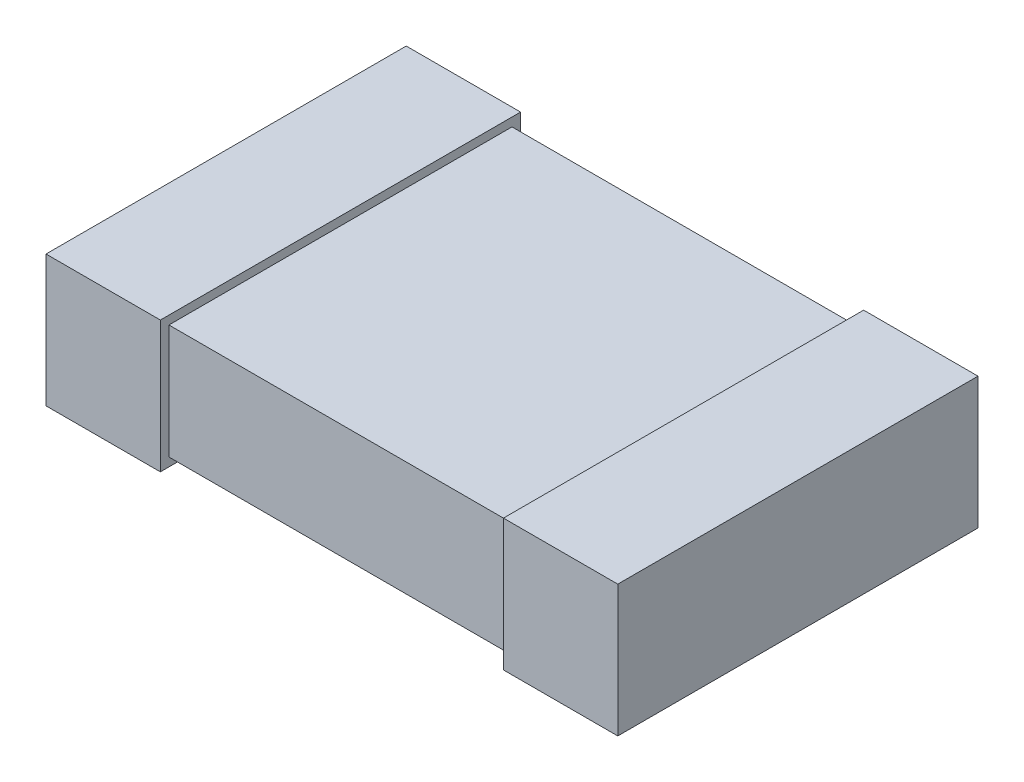
ISO-10303-21;
HEADER;
FILE_DESCRIPTION(('STEP AP214'),'2;1');
FILE_NAME('part.step','',(''),(''),'','','');
FILE_SCHEMA(('AUTOMOTIVE_DESIGN { 1 0 10303 214 1 1 1 1 }'));
ENDSEC;
DATA;
#1=APPLICATION_CONTEXT('core data for automotive mechanical design processes');
#2=APPLICATION_PROTOCOL_DEFINITION('international standard','automotive_design',2000,#1);
#3=PRODUCT_CONTEXT('',#1,'mechanical');
#4=PRODUCT('Part','Part','',(#3));
#5=PRODUCT_RELATED_PRODUCT_CATEGORY('part','',(#4));
#6=PRODUCT_DEFINITION_FORMATION('','',#4);
#7=PRODUCT_DEFINITION_CONTEXT('part definition',#1,'design');
#8=PRODUCT_DEFINITION('design','',#6,#7);
#9=PRODUCT_DEFINITION_SHAPE('','',#8);
#10=(LENGTH_UNIT() NAMED_UNIT(*) SI_UNIT(.MILLI.,.METRE.));
#11=(NAMED_UNIT(*) PLANE_ANGLE_UNIT() SI_UNIT($,.RADIAN.));
#12=(NAMED_UNIT(*) SI_UNIT($,.STERADIAN.) SOLID_ANGLE_UNIT());
#13=UNCERTAINTY_MEASURE_WITH_UNIT(LENGTH_MEASURE(1.E-05),#10,'distance_accuracy_value','');
#14=(GEOMETRIC_REPRESENTATION_CONTEXT(3) GLOBAL_UNCERTAINTY_ASSIGNED_CONTEXT((#13)) GLOBAL_UNIT_ASSIGNED_CONTEXT((#10,
#11,#12)) REPRESENTATION_CONTEXT('',''));
#15=CARTESIAN_POINT('',(0.,0.,0.));
#16=DIRECTION('',(0.,0.,1.));
#17=DIRECTION('',(1.,0.,0.));
#18=AXIS2_PLACEMENT_3D('',#15,#16,#17);
#19=CARTESIAN_POINT('',(-1.,0.4,0.6));
#20=DIRECTION('',(0.,0.,-1.));
#21=DIRECTION('',(-1.,0.,0.));
#22=AXIS2_PLACEMENT_3D('',#19,#20,#21);
#23=PLANE('',#22);
#24=DIRECTION('',(0.,-1.,0.));
#25=VECTOR('',#24,1.);
#26=CARTESIAN_POINT('',(0.6,0.4,0.6));
#27=LINE('',#26,#25);
#28=CARTESIAN_POINT('',(0.6,0.4,0.6));
#29=VERTEX_POINT('',#28);
#30=CARTESIAN_POINT('',(0.6,0.,0.6));
#31=VERTEX_POINT('',#30);
#32=EDGE_CURVE('E50',#29,#31,#27,.T.);
#33=ORIENTED_EDGE('',*,*,#32,.F.);
#34=DIRECTION('',(1.,0.,0.));
#35=VECTOR('',#34,1.);
#36=CARTESIAN_POINT('',(-1.,0.4,0.6));
#37=LINE('',#36,#35);
#38=CARTESIAN_POINT('',(-0.6,0.4,0.6));
#39=VERTEX_POINT('',#38);
#40=EDGE_CURVE('E215',#39,#29,#37,.T.);
#41=ORIENTED_EDGE('',*,*,#40,.F.);
#42=DIRECTION('',(0.,1.,0.));
#43=VECTOR('',#42,1.);
#44=CARTESIAN_POINT('',(-0.6,0.4,0.6));
#45=LINE('',#44,#43);
#46=CARTESIAN_POINT('',(-0.6,0.,0.6));
#47=VERTEX_POINT('',#46);
#48=EDGE_CURVE('E209',#47,#39,#45,.T.);
#49=ORIENTED_EDGE('',*,*,#48,.F.);
#50=DIRECTION('',(1.,0.,0.));
#51=VECTOR('',#50,1.);
#52=CARTESIAN_POINT('',(-1.,0.,0.6));
#53=LINE('',#52,#51);
#54=EDGE_CURVE('E214',#47,#31,#53,.T.);
#55=ORIENTED_EDGE('',*,*,#54,.T.);
#56=EDGE_LOOP('',(#33,#41,#49,#55));
#57=FACE_BOUND('',#56,.T.);
#58=ADVANCED_FACE('F35',(#57),#23,.F.);
#59=CARTESIAN_POINT('',(-1.,0.4,-0.6));
#60=DIRECTION('',(0.,0.,1.));
#61=DIRECTION('',(1.,0.,0.));
#62=AXIS2_PLACEMENT_3D('',#59,#60,#61);
#63=PLANE('',#62);
#64=DIRECTION('',(0.,1.,0.));
#65=VECTOR('',#64,1.);
#66=CARTESIAN_POINT('',(0.6,0.4,-0.6));
#67=LINE('',#66,#65);
#68=CARTESIAN_POINT('',(0.6,0.,-0.6));
#69=VERTEX_POINT('',#68);
#70=CARTESIAN_POINT('',(0.6,0.4,-0.6));
#71=VERTEX_POINT('',#70);
#72=EDGE_CURVE('E164',#69,#71,#67,.T.);
#73=ORIENTED_EDGE('',*,*,#72,.F.);
#74=DIRECTION('',(-1.,0.,0.));
#75=VECTOR('',#74,1.);
#76=CARTESIAN_POINT('',(-1.,0.,-0.6));
#77=LINE('',#76,#75);
#78=CARTESIAN_POINT('',(-0.6,0.,-0.6));
#79=VERTEX_POINT('',#78);
#80=EDGE_CURVE('E218',#69,#79,#77,.T.);
#81=ORIENTED_EDGE('',*,*,#80,.T.);
#82=DIRECTION('',(0.,-1.,0.));
#83=VECTOR('',#82,1.);
#84=CARTESIAN_POINT('',(-0.6,0.4,-0.6));
#85=LINE('',#84,#83);
#86=CARTESIAN_POINT('',(-0.6,0.4,-0.6));
#87=VERTEX_POINT('',#86);
#88=EDGE_CURVE('E197',#87,#79,#85,.T.);
#89=ORIENTED_EDGE('',*,*,#88,.F.);
#90=DIRECTION('',(-1.,0.,0.));
#91=VECTOR('',#90,1.);
#92=CARTESIAN_POINT('',(-1.,0.4,-0.6));
#93=LINE('',#92,#91);
#94=EDGE_CURVE('E217',#71,#87,#93,.T.);
#95=ORIENTED_EDGE('',*,*,#94,.F.);
#96=EDGE_LOOP('',(#73,#81,#89,#95));
#97=FACE_BOUND('',#96,.T.);
#98=ADVANCED_FACE('F235',(#97),#63,.F.);
#99=CARTESIAN_POINT('',(-1.,0.4,0.6));
#100=DIRECTION('',(0.,1.,0.));
#101=DIRECTION('',(0.,0.,1.));
#102=AXIS2_PLACEMENT_3D('',#99,#100,#101);
#103=PLANE('',#102);
#104=ORIENTED_EDGE('',*,*,#40,.T.);
#105=DIRECTION('',(0.,0.,-1.));
#106=VECTOR('',#105,1.);
#107=CARTESIAN_POINT('',(0.6,0.4,0.6));
#108=LINE('',#107,#106);
#109=EDGE_CURVE('E57',#29,#71,#108,.T.);
#110=ORIENTED_EDGE('',*,*,#109,.T.);
#111=ORIENTED_EDGE('',*,*,#94,.T.);
#112=DIRECTION('',(0.,0.,1.));
#113=VECTOR('',#112,1.);
#114=CARTESIAN_POINT('',(-0.6,0.4,0.6));
#115=LINE('',#114,#113);
#116=EDGE_CURVE('E212',#87,#39,#115,.T.);
#117=ORIENTED_EDGE('',*,*,#116,.T.);
#118=EDGE_LOOP('',(#104,#110,#111,#117));
#119=FACE_BOUND('',#118,.T.);
#120=ADVANCED_FACE('F232',(#119),#103,.T.);
#121=CARTESIAN_POINT('',(-1.,0.,0.6));
#122=DIRECTION('',(0.,1.,0.));
#123=DIRECTION('',(0.,0.,1.));
#124=AXIS2_PLACEMENT_3D('',#121,#122,#123);
#125=PLANE('',#124);
#126=DIRECTION('',(0.,0.,-1.));
#127=VECTOR('',#126,1.);
#128=CARTESIAN_POINT('',(0.6,0.,0.6));
#129=LINE('',#128,#127);
#130=EDGE_CURVE('E12',#31,#69,#129,.T.);
#131=ORIENTED_EDGE('',*,*,#130,.F.);
#132=ORIENTED_EDGE('',*,*,#54,.F.);
#133=DIRECTION('',(0.,0.,1.));
#134=VECTOR('',#133,1.);
#135=CARTESIAN_POINT('',(-0.6,0.,0.6));
#136=LINE('',#135,#134);
#137=EDGE_CURVE('E43',#79,#47,#136,.T.);
#138=ORIENTED_EDGE('',*,*,#137,.F.);
#139=ORIENTED_EDGE('',*,*,#80,.F.);
#140=EDGE_LOOP('',(#131,#132,#138,#139));
#141=FACE_BOUND('',#140,.T.);
#142=ADVANCED_FACE('F230',(#141),#125,.F.);
#143=CARTESIAN_POINT('',(-0.6,-0.0299999999999999,1.26959002616513));
#144=DIRECTION('',(0.,1.,0.));
#145=DIRECTION('',(-1.,0.,0.));
#146=AXIS2_PLACEMENT_3D('',#143,#144,#145);
#147=PLANE('',#146);
#148=DIRECTION('',(0.,0.,-1.));
#149=VECTOR('',#148,1.);
#150=CARTESIAN_POINT('',(-0.6,-0.0299999999999999,1.26959002616513));
#151=LINE('',#150,#149);
#152=CARTESIAN_POINT('',(-0.6,-0.0299999999999999,0.63));
#153=VERTEX_POINT('',#152);
#154=CARTESIAN_POINT('',(-0.6,-0.0299999999999999,-0.63));
#155=VERTEX_POINT('',#154);
#156=EDGE_CURVE('E186',#153,#155,#151,.T.);
#157=ORIENTED_EDGE('',*,*,#156,.F.);
#158=DIRECTION('',(-1.,0.,0.));
#159=VECTOR('',#158,1.);
#160=CARTESIAN_POINT('',(-0.6,-0.0299999999999999,0.63));
#161=LINE('',#160,#159);
#162=CARTESIAN_POINT('',(-1.,-0.03,0.63));
#163=VERTEX_POINT('',#162);
#164=EDGE_CURVE('E191',#153,#163,#161,.T.);
#165=ORIENTED_EDGE('',*,*,#164,.T.);
#166=DIRECTION('',(0.,0.,-1.));
#167=VECTOR('',#166,1.);
#168=CARTESIAN_POINT('',(-1.,-0.03,1.26959002616513));
#169=LINE('',#168,#167);
#170=CARTESIAN_POINT('',(-1.,-0.03,-0.63));
#171=VERTEX_POINT('',#170);
#172=EDGE_CURVE('E199',#163,#171,#169,.T.);
#173=ORIENTED_EDGE('',*,*,#172,.T.);
#174=DIRECTION('',(-1.,0.,0.));
#175=VECTOR('',#174,1.);
#176=CARTESIAN_POINT('',(-0.6,-0.0299999999999999,-0.63));
#177=LINE('',#176,#175);
#178=EDGE_CURVE('E177',#155,#171,#177,.T.);
#179=ORIENTED_EDGE('',*,*,#178,.F.);
#180=EDGE_LOOP('',(#157,#165,#173,#179));
#181=FACE_BOUND('',#180,.T.);
#182=ADVANCED_FACE('F276',(#181),#147,.F.);
#183=CARTESIAN_POINT('',(-0.6,0.43,1.26959002616513));
#184=DIRECTION('',(0.,-1.,0.));
#185=DIRECTION('',(1.,0.,0.));
#186=AXIS2_PLACEMENT_3D('',#183,#184,#185);
#187=PLANE('',#186);
#188=DIRECTION('',(0.,0.,-1.));
#189=VECTOR('',#188,1.);
#190=CARTESIAN_POINT('',(-1.,0.43,1.26959002616513));
#191=LINE('',#190,#189);
#192=CARTESIAN_POINT('',(-1.,0.43,0.63));
#193=VERTEX_POINT('',#192);
#194=CARTESIAN_POINT('',(-1.,0.43,-0.63));
#195=VERTEX_POINT('',#194);
#196=EDGE_CURVE('E201',#193,#195,#191,.T.);
#197=ORIENTED_EDGE('',*,*,#196,.F.);
#198=DIRECTION('',(1.,0.,0.));
#199=VECTOR('',#198,1.);
#200=CARTESIAN_POINT('',(-0.6,0.43,0.63));
#201=LINE('',#200,#199);
#202=CARTESIAN_POINT('',(-0.6,0.43,0.63));
#203=VERTEX_POINT('',#202);
#204=EDGE_CURVE('E190',#193,#203,#201,.T.);
#205=ORIENTED_EDGE('',*,*,#204,.T.);
#206=DIRECTION('',(0.,0.,-1.));
#207=VECTOR('',#206,1.);
#208=CARTESIAN_POINT('',(-0.6,0.43,1.26959002616513));
#209=LINE('',#208,#207);
#210=CARTESIAN_POINT('',(-0.6,0.43,-0.63));
#211=VERTEX_POINT('',#210);
#212=EDGE_CURVE('E203',#203,#211,#209,.T.);
#213=ORIENTED_EDGE('',*,*,#212,.T.);
#214=DIRECTION('',(1.,0.,0.));
#215=VECTOR('',#214,1.);
#216=CARTESIAN_POINT('',(-0.6,0.43,-0.63));
#217=LINE('',#216,#215);
#218=EDGE_CURVE('E183',#195,#211,#217,.T.);
#219=ORIENTED_EDGE('',*,*,#218,.F.);
#220=EDGE_LOOP('',(#197,#205,#213,#219));
#221=FACE_BOUND('',#220,.T.);
#222=ADVANCED_FACE('F279',(#221),#187,.F.);
#223=CARTESIAN_POINT('',(-0.6,0.43,1.26959002616513));
#224=DIRECTION('',(-1.,0.,0.));
#225=DIRECTION('',(0.,-1.,0.));
#226=AXIS2_PLACEMENT_3D('',#223,#224,#225);
#227=PLANE('',#226);
#228=ORIENTED_EDGE('',*,*,#116,.F.);
#229=ORIENTED_EDGE('',*,*,#88,.T.);
#230=ORIENTED_EDGE('',*,*,#137,.T.);
#231=ORIENTED_EDGE('',*,*,#48,.T.);
#232=EDGE_LOOP('',(#228,#229,#230,#231));
#233=FACE_BOUND('',#232,.T.);
#234=ORIENTED_EDGE('',*,*,#212,.F.);
#235=DIRECTION('',(0.,-1.,0.));
#236=VECTOR('',#235,1.);
#237=CARTESIAN_POINT('',(-0.6,0.43,0.63));
#238=LINE('',#237,#236);
#239=EDGE_CURVE('E194',#203,#153,#238,.T.);
#240=ORIENTED_EDGE('',*,*,#239,.T.);
#241=ORIENTED_EDGE('',*,*,#156,.T.);
#242=DIRECTION('',(0.,-1.,0.));
#243=VECTOR('',#242,1.);
#244=CARTESIAN_POINT('',(-0.6,0.43,-0.63));
#245=LINE('',#244,#243);
#246=EDGE_CURVE('E180',#211,#155,#245,.T.);
#247=ORIENTED_EDGE('',*,*,#246,.F.);
#248=EDGE_LOOP('',(#234,#240,#241,#247));
#249=FACE_BOUND('',#248,.T.);
#250=ADVANCED_FACE('F225',(#233,#249),#227,.F.);
#251=CARTESIAN_POINT('',(-1.,0.4,0.63));
#252=DIRECTION('',(0.,0.,-1.));
#253=DIRECTION('',(-1.,0.,0.));
#254=AXIS2_PLACEMENT_3D('',#251,#252,#253);
#255=PLANE('',#254);
#256=ORIENTED_EDGE('',*,*,#204,.F.);
#257=DIRECTION('',(0.,1.,0.));
#258=VECTOR('',#257,1.);
#259=CARTESIAN_POINT('',(-1.,0.43,0.63));
#260=LINE('',#259,#258);
#261=EDGE_CURVE('E187',#163,#193,#260,.T.);
#262=ORIENTED_EDGE('',*,*,#261,.F.);
#263=ORIENTED_EDGE('',*,*,#164,.F.);
#264=ORIENTED_EDGE('',*,*,#239,.F.);
#265=EDGE_LOOP('',(#256,#262,#263,#264));
#266=FACE_BOUND('',#265,.T.);
#267=ADVANCED_FACE('F271',(#266),#255,.F.);
#268=CARTESIAN_POINT('',(-1.,0.4,-0.63));
#269=DIRECTION('',(0.,0.,1.));
#270=DIRECTION('',(1.,0.,0.));
#271=AXIS2_PLACEMENT_3D('',#268,#269,#270);
#272=PLANE('',#271);
#273=ORIENTED_EDGE('',*,*,#246,.T.);
#274=ORIENTED_EDGE('',*,*,#178,.T.);
#275=DIRECTION('',(0.,1.,0.));
#276=VECTOR('',#275,1.);
#277=CARTESIAN_POINT('',(-1.,0.43,-0.63));
#278=LINE('',#277,#276);
#279=EDGE_CURVE('E174',#171,#195,#278,.T.);
#280=ORIENTED_EDGE('',*,*,#279,.T.);
#281=ORIENTED_EDGE('',*,*,#218,.T.);
#282=EDGE_LOOP('',(#273,#274,#280,#281));
#283=FACE_BOUND('',#282,.T.);
#284=ADVANCED_FACE('F268',(#283),#272,.F.);
#285=CARTESIAN_POINT('',(-1.,0.4,-0.6));
#286=DIRECTION('',(1.,0.,0.));
#287=DIRECTION('',(0.,0.,-1.));
#288=AXIS2_PLACEMENT_3D('',#285,#286,#287);
#289=PLANE('',#288);
#290=ORIENTED_EDGE('',*,*,#172,.F.);
#291=ORIENTED_EDGE('',*,*,#261,.T.);
#292=ORIENTED_EDGE('',*,*,#196,.T.);
#293=ORIENTED_EDGE('',*,*,#279,.F.);
#294=EDGE_LOOP('',(#290,#291,#292,#293));
#295=FACE_BOUND('',#294,.T.);
#296=ADVANCED_FACE('F37',(#295),#289,.F.);
#297=CARTESIAN_POINT('',(0.6,-0.0299999999999998,1.26959002616513));
#298=DIRECTION('',(0.,1.,0.));
#299=DIRECTION('',(-1.,0.,0.));
#300=AXIS2_PLACEMENT_3D('',#297,#298,#299);
#301=PLANE('',#300);
#302=DIRECTION('',(0.,0.,-1.));
#303=VECTOR('',#302,1.);
#304=CARTESIAN_POINT('',(1.,-0.0299999999999997,1.26959002616513));
#305=LINE('',#304,#303);
#306=CARTESIAN_POINT('',(1.,-0.0299999999999997,0.63));
#307=VERTEX_POINT('',#306);
#308=CARTESIAN_POINT('',(1.,-0.0299999999999997,-0.63));
#309=VERTEX_POINT('',#308);
#310=EDGE_CURVE('E137',#307,#309,#305,.T.);
#311=ORIENTED_EDGE('',*,*,#310,.F.);
#312=DIRECTION('',(-1.,0.,0.));
#313=VECTOR('',#312,1.);
#314=CARTESIAN_POINT('',(0.6,-0.0299999999999998,0.63));
#315=LINE('',#314,#313);
#316=CARTESIAN_POINT('',(0.6,-0.0299999999999998,0.63));
#317=VERTEX_POINT('',#316);
#318=EDGE_CURVE('E132',#307,#317,#315,.T.);
#319=ORIENTED_EDGE('',*,*,#318,.T.);
#320=DIRECTION('',(0.,0.,-1.));
#321=VECTOR('',#320,1.);
#322=CARTESIAN_POINT('',(0.6,-0.0299999999999998,1.26959002616513));
#323=LINE('',#322,#321);
#324=CARTESIAN_POINT('',(0.6,-0.0299999999999998,-0.63));
#325=VERTEX_POINT('',#324);
#326=EDGE_CURVE('E127',#317,#325,#323,.T.);
#327=ORIENTED_EDGE('',*,*,#326,.T.);
#328=DIRECTION('',(-1.,0.,0.));
#329=VECTOR('',#328,1.);
#330=CARTESIAN_POINT('',(0.6,-0.0299999999999998,-0.63));
#331=LINE('',#330,#329);
#332=EDGE_CURVE('E131',#309,#325,#331,.T.);
#333=ORIENTED_EDGE('',*,*,#332,.F.);
#334=EDGE_LOOP('',(#311,#319,#327,#333));
#335=FACE_BOUND('',#334,.T.);
#336=ADVANCED_FACE('F130',(#335),#301,.F.);
#337=CARTESIAN_POINT('',(0.6,0.43,1.26959002616513));
#338=DIRECTION('',(1.,0.,0.));
#339=DIRECTION('',(0.,1.,0.));
#340=AXIS2_PLACEMENT_3D('',#337,#338,#339);
#341=PLANE('',#340);
#342=ORIENTED_EDGE('',*,*,#109,.F.);
#343=ORIENTED_EDGE('',*,*,#32,.T.);
#344=ORIENTED_EDGE('',*,*,#130,.T.);
#345=ORIENTED_EDGE('',*,*,#72,.T.);
#346=EDGE_LOOP('',(#342,#343,#344,#345));
#347=FACE_BOUND('',#346,.T.);
#348=ORIENTED_EDGE('',*,*,#326,.F.);
#349=DIRECTION('',(0.,1.,0.));
#350=VECTOR('',#349,1.);
#351=CARTESIAN_POINT('',(0.6,0.43,0.63));
#352=LINE('',#351,#350);
#353=CARTESIAN_POINT('',(0.6,0.43,0.63));
#354=VERTEX_POINT('',#353);
#355=EDGE_CURVE('E159',#317,#354,#352,.T.);
#356=ORIENTED_EDGE('',*,*,#355,.T.);
#357=DIRECTION('',(0.,0.,-1.));
#358=VECTOR('',#357,1.);
#359=CARTESIAN_POINT('',(0.6,0.43,1.26959002616513));
#360=LINE('',#359,#358);
#361=CARTESIAN_POINT('',(0.6,0.43,-0.63));
#362=VERTEX_POINT('',#361);
#363=EDGE_CURVE('E136',#354,#362,#360,.T.);
#364=ORIENTED_EDGE('',*,*,#363,.T.);
#365=DIRECTION('',(0.,1.,0.));
#366=VECTOR('',#365,1.);
#367=CARTESIAN_POINT('',(0.6,0.43,-0.63));
#368=LINE('',#367,#366);
#369=EDGE_CURVE('E144',#325,#362,#368,.T.);
#370=ORIENTED_EDGE('',*,*,#369,.F.);
#371=EDGE_LOOP('',(#348,#356,#364,#370));
#372=FACE_BOUND('',#371,.T.);
#373=ADVANCED_FACE('F149',(#347,#372),#341,.F.);
#374=CARTESIAN_POINT('',(0.6,0.43,1.26959002616513));
#375=DIRECTION('',(0.,-1.,0.));
#376=DIRECTION('',(1.,0.,0.));
#377=AXIS2_PLACEMENT_3D('',#374,#375,#376);
#378=PLANE('',#377);
#379=ORIENTED_EDGE('',*,*,#363,.F.);
#380=DIRECTION('',(1.,0.,0.));
#381=VECTOR('',#380,1.);
#382=CARTESIAN_POINT('',(0.6,0.43,0.63));
#383=LINE('',#382,#381);
#384=CARTESIAN_POINT('',(1.,0.43,0.63));
#385=VERTEX_POINT('',#384);
#386=EDGE_CURVE('E162',#354,#385,#383,.T.);
#387=ORIENTED_EDGE('',*,*,#386,.T.);
#388=DIRECTION('',(0.,0.,-1.));
#389=VECTOR('',#388,1.);
#390=CARTESIAN_POINT('',(1.,0.43,1.26959002616513));
#391=LINE('',#390,#389);
#392=CARTESIAN_POINT('',(1.,0.43,-0.63));
#393=VERTEX_POINT('',#392);
#394=EDGE_CURVE('E151',#385,#393,#391,.T.);
#395=ORIENTED_EDGE('',*,*,#394,.T.);
#396=DIRECTION('',(1.,0.,0.));
#397=VECTOR('',#396,1.);
#398=CARTESIAN_POINT('',(0.6,0.43,-0.63));
#399=LINE('',#398,#397);
#400=EDGE_CURVE('E152',#362,#393,#399,.T.);
#401=ORIENTED_EDGE('',*,*,#400,.F.);
#402=EDGE_LOOP('',(#379,#387,#395,#401));
#403=FACE_BOUND('',#402,.T.);
#404=ADVANCED_FACE('F255',(#403),#378,.F.);
#405=CARTESIAN_POINT('',(-1.,0.4,0.63));
#406=DIRECTION('',(0.,0.,-1.));
#407=DIRECTION('',(-1.,0.,0.));
#408=AXIS2_PLACEMENT_3D('',#405,#406,#407);
#409=PLANE('',#408);
#410=ORIENTED_EDGE('',*,*,#355,.F.);
#411=ORIENTED_EDGE('',*,*,#318,.F.);
#412=DIRECTION('',(0.,-1.,0.));
#413=VECTOR('',#412,1.);
#414=CARTESIAN_POINT('',(1.,0.43,0.63));
#415=LINE('',#414,#413);
#416=EDGE_CURVE('E160',#385,#307,#415,.T.);
#417=ORIENTED_EDGE('',*,*,#416,.F.);
#418=ORIENTED_EDGE('',*,*,#386,.F.);
#419=EDGE_LOOP('',(#410,#411,#417,#418));
#420=FACE_BOUND('',#419,.T.);
#421=ADVANCED_FACE('F251',(#420),#409,.F.);
#422=CARTESIAN_POINT('',(-1.,0.4,-0.63));
#423=DIRECTION('',(0.,0.,1.));
#424=DIRECTION('',(1.,0.,0.));
#425=AXIS2_PLACEMENT_3D('',#422,#423,#424);
#426=PLANE('',#425);
#427=ORIENTED_EDGE('',*,*,#400,.T.);
#428=DIRECTION('',(0.,-1.,0.));
#429=VECTOR('',#428,1.);
#430=CARTESIAN_POINT('',(1.,0.43,-0.63));
#431=LINE('',#430,#429);
#432=EDGE_CURVE('E147',#393,#309,#431,.T.);
#433=ORIENTED_EDGE('',*,*,#432,.T.);
#434=ORIENTED_EDGE('',*,*,#332,.T.);
#435=ORIENTED_EDGE('',*,*,#369,.T.);
#436=EDGE_LOOP('',(#427,#433,#434,#435));
#437=FACE_BOUND('',#436,.T.);
#438=ADVANCED_FACE('F143',(#437),#426,.F.);
#439=CARTESIAN_POINT('',(1.,0.4,-0.6));
#440=DIRECTION('',(-1.,0.,0.));
#441=DIRECTION('',(0.,0.,1.));
#442=AXIS2_PLACEMENT_3D('',#439,#440,#441);
#443=PLANE('',#442);
#444=ORIENTED_EDGE('',*,*,#394,.F.);
#445=ORIENTED_EDGE('',*,*,#416,.T.);
#446=ORIENTED_EDGE('',*,*,#310,.T.);
#447=ORIENTED_EDGE('',*,*,#432,.F.);
#448=EDGE_LOOP('',(#444,#445,#446,#447));
#449=FACE_BOUND('',#448,.T.);
#450=ADVANCED_FACE('F245',(#449),#443,.F.);
#451=CLOSED_SHELL('',(#58,#98,#120,#142,#182,#222,#250,#267,#284,#296,#336,#373,#404,#421,#438,#450));
#452=MANIFOLD_SOLID_BREP('B2',#451);
#453=ADVANCED_BREP_SHAPE_REPRESENTATION('',(#18,#452),#14);
#454=SHAPE_DEFINITION_REPRESENTATION(#9,#453);
ENDSEC;
END-ISO-10303-21;
